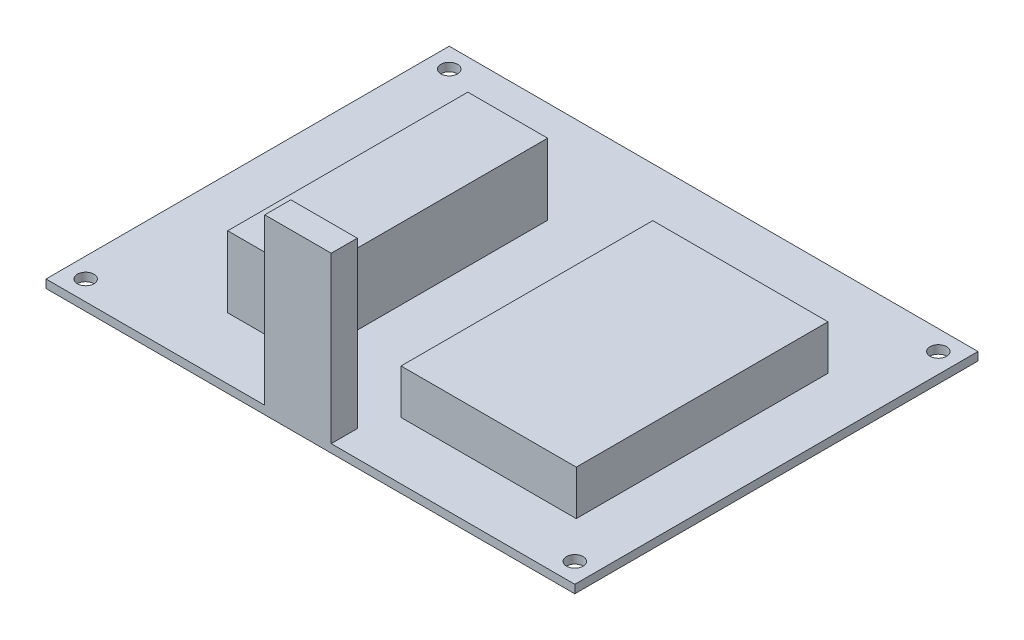
ISO-10303-21;
HEADER;
FILE_DESCRIPTION(('STEP AP214'),'2;1');
FILE_NAME('part.step','',(''),(''),'','','');
FILE_SCHEMA(('AUTOMOTIVE_DESIGN { 1 0 10303 214 1 1 1 1 }'));
ENDSEC;
DATA;
#1=APPLICATION_CONTEXT('core data for automotive mechanical design processes');
#2=APPLICATION_PROTOCOL_DEFINITION('international standard','automotive_design',2000,#1);
#3=PRODUCT_CONTEXT('',#1,'mechanical');
#4=PRODUCT('Part','Part','',(#3));
#5=PRODUCT_RELATED_PRODUCT_CATEGORY('part','',(#4));
#6=PRODUCT_DEFINITION_FORMATION('','',#4);
#7=PRODUCT_DEFINITION_CONTEXT('part definition',#1,'design');
#8=PRODUCT_DEFINITION('design','',#6,#7);
#9=PRODUCT_DEFINITION_SHAPE('','',#8);
#10=(LENGTH_UNIT() NAMED_UNIT(*) SI_UNIT(.MILLI.,.METRE.));
#11=(NAMED_UNIT(*) PLANE_ANGLE_UNIT() SI_UNIT($,.RADIAN.));
#12=(NAMED_UNIT(*) SI_UNIT($,.STERADIAN.) SOLID_ANGLE_UNIT());
#13=UNCERTAINTY_MEASURE_WITH_UNIT(LENGTH_MEASURE(1.E-05),#10,'distance_accuracy_value','');
#14=(GEOMETRIC_REPRESENTATION_CONTEXT(3) GLOBAL_UNCERTAINTY_ASSIGNED_CONTEXT((#13)) GLOBAL_UNIT_ASSIGNED_CONTEXT((#10,
#11,#12)) REPRESENTATION_CONTEXT('',''));
#15=CARTESIAN_POINT('',(0.,0.,0.));
#16=DIRECTION('',(0.,0.,1.));
#17=DIRECTION('',(1.,0.,0.));
#18=AXIS2_PLACEMENT_3D('',#15,#16,#17);
#19=CARTESIAN_POINT('',(0.,1.5875,0.));
#20=DIRECTION('',(0.,1.,0.));
#21=DIRECTION('',(0.,0.,1.));
#22=AXIS2_PLACEMENT_3D('',#19,#20,#21);
#23=PLANE('',#22);
#24=DIRECTION('',(-1.,0.,0.));
#25=VECTOR('',#24,1.);
#26=CARTESIAN_POINT('',(0.,1.5875,11.2894063021906));
#27=LINE('',#26,#25);
#28=CARTESIAN_POINT('',(-6.55312926281065,1.5875,11.2894063021906));
#29=VERTEX_POINT('',#28);
#30=CARTESIAN_POINT('',(-40.2178135144147,1.5875,11.2894063021906));
#31=VERTEX_POINT('',#30);
#32=EDGE_CURVE('E211',#29,#31,#27,.T.);
#33=ORIENTED_EDGE('',*,*,#32,.T.);
#34=DIRECTION('',(0.,0.,-1.));
#35=VECTOR('',#34,1.);
#36=CARTESIAN_POINT('',(-40.2178135144147,1.5875,0.));
#37=LINE('',#36,#35);
#38=CARTESIAN_POINT('',(-40.2178135144147,1.5875,-37.0793929098841));
#39=VERTEX_POINT('',#38);
#40=EDGE_CURVE('E214',#31,#39,#37,.T.);
#41=ORIENTED_EDGE('',*,*,#40,.T.);
#42=DIRECTION('',(1.,0.,0.));
#43=VECTOR('',#42,1.);
#44=CARTESIAN_POINT('',(0.,1.5875,-37.0793929098841));
#45=LINE('',#44,#43);
#46=CARTESIAN_POINT('',(-6.55312926281065,1.5875,-37.0793929098841));
#47=VERTEX_POINT('',#46);
#48=EDGE_CURVE('E205',#39,#47,#45,.T.);
#49=ORIENTED_EDGE('',*,*,#48,.T.);
#50=DIRECTION('',(0.,0.,1.));
#51=VECTOR('',#50,1.);
#52=CARTESIAN_POINT('',(-6.55312926281065,1.5875,0.));
#53=LINE('',#52,#51);
#54=EDGE_CURVE('E208',#47,#29,#53,.T.);
#55=ORIENTED_EDGE('',*,*,#54,.T.);
#56=EDGE_LOOP('',(#33,#41,#49,#55));
#57=FACE_BOUND('',#56,.T.);
#58=CARTESIAN_POINT('',(-93.5609765361476,1.5875,18.5415943631717));
#59=DIRECTION('',(0.,1.,0.));
#60=DIRECTION('',(0.,0.,1.));
#61=AXIS2_PLACEMENT_3D('',#58,#59,#60);
#62=CIRCLE('',#61,1.6002);
#63=CARTESIAN_POINT('',(-93.5609765361476,1.5875,20.1417943631717));
#64=VERTEX_POINT('',#63);
#65=EDGE_CURVE('E256',#64,#64,#62,.T.);
#66=ORIENTED_EDGE('',*,*,#65,.F.);
#67=EDGE_LOOP('',(#66));
#68=FACE_BOUND('',#67,.T.);
#69=CARTESIAN_POINT('',(-93.5609765361476,1.5875,-51.3084056368283));
#70=DIRECTION('',(0.,1.,0.));
#71=DIRECTION('',(0.,0.,1.));
#72=AXIS2_PLACEMENT_3D('',#69,#70,#71);
#73=CIRCLE('',#72,1.6002);
#74=CARTESIAN_POINT('',(-93.5609765361476,1.5875,-49.7082056368283));
#75=VERTEX_POINT('',#74);
#76=EDGE_CURVE('E252',#75,#75,#73,.T.);
#77=ORIENTED_EDGE('',*,*,#76,.F.);
#78=EDGE_LOOP('',(#77));
#79=FACE_BOUND('',#78,.T.);
#80=CARTESIAN_POINT('',(0.419023463852378,1.5875,-51.3084056368283));
#81=DIRECTION('',(0.,1.,0.));
#82=DIRECTION('',(0.,0.,1.));
#83=AXIS2_PLACEMENT_3D('',#80,#81,#82);
#84=CIRCLE('',#83,1.6002);
#85=CARTESIAN_POINT('',(0.419023463852378,1.5875,-49.7082056368283));
#86=VERTEX_POINT('',#85);
#87=EDGE_CURVE('E248',#86,#86,#84,.T.);
#88=ORIENTED_EDGE('',*,*,#87,.F.);
#89=EDGE_LOOP('',(#88));
#90=FACE_BOUND('',#89,.T.);
#91=CARTESIAN_POINT('',(0.419023463852378,1.5875,18.5415943631717));
#92=DIRECTION('',(0.,1.,0.));
#93=DIRECTION('',(0.,0.,1.));
#94=AXIS2_PLACEMENT_3D('',#91,#92,#93);
#95=CIRCLE('',#94,1.6002);
#96=CARTESIAN_POINT('',(0.419023463852378,1.5875,20.1417943631717));
#97=VERTEX_POINT('',#96);
#98=EDGE_CURVE('E245',#97,#97,#95,.T.);
#99=ORIENTED_EDGE('',*,*,#98,.F.);
#100=EDGE_LOOP('',(#99));
#101=FACE_BOUND('',#100,.T.);
#102=DIRECTION('',(1.,0.,0.));
#103=VECTOR('',#102,1.);
#104=CARTESIAN_POINT('',(-97.3709765361476,1.5875,22.3515943631717));
#105=LINE('',#104,#103);
#106=CARTESIAN_POINT('',(-97.3709765361476,1.5875,22.3515943631717));
#107=VERTEX_POINT('',#106);
#108=CARTESIAN_POINT('',(-55.3418521266038,1.5875,22.3515943631717));
#109=VERTEX_POINT('',#108);
#110=EDGE_CURVE('E265',#107,#109,#105,.T.);
#111=ORIENTED_EDGE('',*,*,#110,.T.);
#112=DIRECTION('',(0.,0.,-1.));
#113=VECTOR('',#112,1.);
#114=CARTESIAN_POINT('',(-55.3418521266038,1.5875,0.));
#115=LINE('',#114,#113);
#116=CARTESIAN_POINT('',(-55.3418521266038,1.5875,17.3457703470585));
#117=VERTEX_POINT('',#116);
#118=EDGE_CURVE('E242',#109,#117,#115,.T.);
#119=ORIENTED_EDGE('',*,*,#118,.T.);
#120=DIRECTION('',(1.,0.,0.));
#121=VECTOR('',#120,1.);
#122=CARTESIAN_POINT('',(0.,1.5875,17.3457703470585));
#123=LINE('',#122,#121);
#124=CARTESIAN_POINT('',(-42.5724891346161,1.5875,17.3457703470585));
#125=VERTEX_POINT('',#124);
#126=EDGE_CURVE('E236',#117,#125,#123,.T.);
#127=ORIENTED_EDGE('',*,*,#126,.T.);
#128=DIRECTION('',(0.,0.,1.));
#129=VECTOR('',#128,1.);
#130=CARTESIAN_POINT('',(-42.5724891346161,1.5875,0.));
#131=LINE('',#130,#129);
#132=CARTESIAN_POINT('',(-42.5724891346161,1.5875,22.3515943631717));
#133=VERTEX_POINT('',#132);
#134=EDGE_CURVE('E239',#125,#133,#131,.T.);
#135=ORIENTED_EDGE('',*,*,#134,.T.);
#136=CARTESIAN_POINT('',(4.22902346385238,1.5875,22.3515943631717));
#137=VERTEX_POINT('',#136);
#138=EDGE_CURVE('E263',#133,#137,#105,.T.);
#139=ORIENTED_EDGE('',*,*,#138,.T.);
#140=DIRECTION('',(0.,0.,-1.));
#141=VECTOR('',#140,1.);
#142=CARTESIAN_POINT('',(4.22902346385237,1.5875,-55.1184056368283));
#143=LINE('',#142,#141);
#144=CARTESIAN_POINT('',(4.22902346385237,1.5875,-55.1184056368283));
#145=VERTEX_POINT('',#144);
#146=EDGE_CURVE('E268',#137,#145,#143,.T.);
#147=ORIENTED_EDGE('',*,*,#146,.T.);
#148=DIRECTION('',(-1.,0.,0.));
#149=VECTOR('',#148,1.);
#150=CARTESIAN_POINT('',(-97.3709765361476,1.5875,-55.1184056368283));
#151=LINE('',#150,#149);
#152=CARTESIAN_POINT('',(-97.3709765361476,1.5875,-55.1184056368283));
#153=VERTEX_POINT('',#152);
#154=EDGE_CURVE('E270',#145,#153,#151,.T.);
#155=ORIENTED_EDGE('',*,*,#154,.T.);
#156=DIRECTION('',(0.,0.,1.));
#157=VECTOR('',#156,1.);
#158=CARTESIAN_POINT('',(-97.3709765361476,1.5875,-55.1184056368283));
#159=LINE('',#158,#157);
#160=EDGE_CURVE('E260',#153,#107,#159,.T.);
#161=ORIENTED_EDGE('',*,*,#160,.T.);
#162=EDGE_LOOP('',(#111,#119,#127,#135,#139,#147,#155,#161));
#163=FACE_BOUND('',#162,.T.);
#164=DIRECTION('',(-1.,0.,0.));
#165=VECTOR('',#164,1.);
#166=CARTESIAN_POINT('',(0.,1.5875,10.5252572660355));
#167=LINE('',#166,#165);
#168=CARTESIAN_POINT('',(-58.9533891344387,1.5875,10.5252572660355));
#169=VERTEX_POINT('',#168);
#170=CARTESIAN_POINT('',(-74.2857110092485,1.5875,10.5252572660355));
#171=VERTEX_POINT('',#170);
#172=EDGE_CURVE('E183',#169,#171,#167,.T.);
#173=ORIENTED_EDGE('',*,*,#172,.T.);
#174=DIRECTION('',(0.,0.,-1.));
#175=VECTOR('',#174,1.);
#176=CARTESIAN_POINT('',(-74.2857110092485,1.5875,0.));
#177=LINE('',#176,#175);
#178=CARTESIAN_POINT('',(-74.2857110092485,1.5875,-35.6136948446562));
#179=VERTEX_POINT('',#178);
#180=EDGE_CURVE('E172',#171,#179,#177,.T.);
#181=ORIENTED_EDGE('',*,*,#180,.T.);
#182=DIRECTION('',(1.,0.,0.));
#183=VECTOR('',#182,1.);
#184=CARTESIAN_POINT('',(0.,1.5875,-35.6136948446562));
#185=LINE('',#184,#183);
#186=CARTESIAN_POINT('',(-58.9533891344387,1.5875,-35.6136948446562));
#187=VERTEX_POINT('',#186);
#188=EDGE_CURVE('E173',#179,#187,#185,.T.);
#189=ORIENTED_EDGE('',*,*,#188,.T.);
#190=DIRECTION('',(0.,0.,1.));
#191=VECTOR('',#190,1.);
#192=CARTESIAN_POINT('',(-58.9533891344387,1.5875,0.));
#193=LINE('',#192,#191);
#194=EDGE_CURVE('E176',#187,#169,#193,.T.);
#195=ORIENTED_EDGE('',*,*,#194,.T.);
#196=EDGE_LOOP('',(#173,#181,#189,#195));
#197=FACE_BOUND('',#196,.T.);
#198=ADVANCED_FACE('F33',(#57,#68,#79,#90,#101,#163,#197),#23,.T.);
#199=CARTESIAN_POINT('',(-97.3709765361476,1.5875,-55.1184056368283));
#200=DIRECTION('',(1.,0.,0.));
#201=DIRECTION('',(0.,0.,-1.));
#202=AXIS2_PLACEMENT_3D('',#199,#200,#201);
#203=PLANE('',#202);
#204=DIRECTION('',(0.,0.,1.));
#205=VECTOR('',#204,1.);
#206=CARTESIAN_POINT('',(-97.3709765361476,0.,-55.1184056368283));
#207=LINE('',#206,#205);
#208=CARTESIAN_POINT('',(-97.3709765361476,0.,-55.1184056368283));
#209=VERTEX_POINT('',#208);
#210=CARTESIAN_POINT('',(-97.3709765361476,0.,22.3515943631717));
#211=VERTEX_POINT('',#210);
#212=EDGE_CURVE('E273',#209,#211,#207,.T.);
#213=ORIENTED_EDGE('',*,*,#212,.T.);
#214=DIRECTION('',(0.,-1.,0.));
#215=VECTOR('',#214,1.);
#216=CARTESIAN_POINT('',(-97.3709765361476,1.5875,22.3515943631717));
#217=LINE('',#216,#215);
#218=EDGE_CURVE('E11',#107,#211,#217,.T.);
#219=ORIENTED_EDGE('',*,*,#218,.F.);
#220=ORIENTED_EDGE('',*,*,#160,.F.);
#221=DIRECTION('',(0.,-1.,0.));
#222=VECTOR('',#221,1.);
#223=CARTESIAN_POINT('',(-97.3709765361476,1.5875,-55.1184056368283));
#224=LINE('',#223,#222);
#225=EDGE_CURVE('E272',#153,#209,#224,.T.);
#226=ORIENTED_EDGE('',*,*,#225,.T.);
#227=EDGE_LOOP('',(#213,#219,#220,#226));
#228=FACE_BOUND('',#227,.T.);
#229=ADVANCED_FACE('F35',(#228),#203,.F.);
#230=CARTESIAN_POINT('',(-97.3709765361476,1.5875,22.3515943631717));
#231=DIRECTION('',(0.,0.,-1.));
#232=DIRECTION('',(-1.,0.,0.));
#233=AXIS2_PLACEMENT_3D('',#230,#231,#232);
#234=PLANE('',#233);
#235=DIRECTION('',(1.,0.,0.));
#236=VECTOR('',#235,1.);
#237=CARTESIAN_POINT('',(-97.3709765361476,0.,22.3515943631717));
#238=LINE('',#237,#236);
#239=CARTESIAN_POINT('',(4.22902346385238,0.,22.3515943631717));
#240=VERTEX_POINT('',#239);
#241=EDGE_CURVE('E276',#211,#240,#238,.T.);
#242=ORIENTED_EDGE('',*,*,#241,.T.);
#243=DIRECTION('',(0.,-1.,0.));
#244=VECTOR('',#243,1.);
#245=CARTESIAN_POINT('',(4.22902346385238,1.5875,22.3515943631717));
#246=LINE('',#245,#244);
#247=EDGE_CURVE('E42',#137,#240,#246,.T.);
#248=ORIENTED_EDGE('',*,*,#247,.F.);
#249=ORIENTED_EDGE('',*,*,#138,.F.);
#250=DIRECTION('',(0.,-1.,0.));
#251=VECTOR('',#250,1.);
#252=CARTESIAN_POINT('',(-42.5724891346161,33.274,22.3515943631717));
#253=LINE('',#252,#251);
#254=CARTESIAN_POINT('',(-42.5724891346161,33.274,22.3515943631717));
#255=VERTEX_POINT('',#254);
#256=EDGE_CURVE('E231',#255,#133,#253,.T.);
#257=ORIENTED_EDGE('',*,*,#256,.F.);
#258=DIRECTION('',(1.,0.,0.));
#259=VECTOR('',#258,1.);
#260=CARTESIAN_POINT('',(-55.3418521266038,33.274,22.3515943631717));
#261=LINE('',#260,#259);
#262=CARTESIAN_POINT('',(-55.3418521266038,33.274,22.3515943631717));
#263=VERTEX_POINT('',#262);
#264=EDGE_CURVE('E220',#263,#255,#261,.T.);
#265=ORIENTED_EDGE('',*,*,#264,.F.);
#266=DIRECTION('',(0.,-1.,0.));
#267=VECTOR('',#266,1.);
#268=CARTESIAN_POINT('',(-55.3418521266038,33.274,22.3515943631717));
#269=LINE('',#268,#267);
#270=EDGE_CURVE('E233',#263,#109,#269,.T.);
#271=ORIENTED_EDGE('',*,*,#270,.T.);
#272=ORIENTED_EDGE('',*,*,#110,.F.);
#273=ORIENTED_EDGE('',*,*,#218,.T.);
#274=EDGE_LOOP('',(#242,#248,#249,#257,#265,#271,#272,#273));
#275=FACE_BOUND('',#274,.T.);
#276=ADVANCED_FACE('F319',(#275),#234,.F.);
#277=CARTESIAN_POINT('',(4.22902346385237,1.5875,-55.1184056368283));
#278=DIRECTION('',(-1.,0.,0.));
#279=DIRECTION('',(0.,0.,1.));
#280=AXIS2_PLACEMENT_3D('',#277,#278,#279);
#281=PLANE('',#280);
#282=DIRECTION('',(0.,0.,-1.));
#283=VECTOR('',#282,1.);
#284=CARTESIAN_POINT('',(4.22902346385237,0.,-55.1184056368283));
#285=LINE('',#284,#283);
#286=CARTESIAN_POINT('',(4.22902346385237,0.,-55.1184056368283));
#287=VERTEX_POINT('',#286);
#288=EDGE_CURVE('E278',#240,#287,#285,.T.);
#289=ORIENTED_EDGE('',*,*,#288,.T.);
#290=DIRECTION('',(0.,-1.,0.));
#291=VECTOR('',#290,1.);
#292=CARTESIAN_POINT('',(4.22902346385237,1.5875,-55.1184056368283));
#293=LINE('',#292,#291);
#294=EDGE_CURVE('E283',#145,#287,#293,.T.);
#295=ORIENTED_EDGE('',*,*,#294,.F.);
#296=ORIENTED_EDGE('',*,*,#146,.F.);
#297=ORIENTED_EDGE('',*,*,#247,.T.);
#298=EDGE_LOOP('',(#289,#295,#296,#297));
#299=FACE_BOUND('',#298,.T.);
#300=ADVANCED_FACE('F330',(#299),#281,.F.);
#301=CARTESIAN_POINT('',(-97.3709765361476,1.5875,-55.1184056368283));
#302=DIRECTION('',(0.,0.,1.));
#303=DIRECTION('',(1.,0.,0.));
#304=AXIS2_PLACEMENT_3D('',#301,#302,#303);
#305=PLANE('',#304);
#306=DIRECTION('',(-1.,0.,0.));
#307=VECTOR('',#306,1.);
#308=CARTESIAN_POINT('',(-97.3709765361476,0.,-55.1184056368283));
#309=LINE('',#308,#307);
#310=EDGE_CURVE('E264',#287,#209,#309,.T.);
#311=ORIENTED_EDGE('',*,*,#310,.T.);
#312=ORIENTED_EDGE('',*,*,#225,.F.);
#313=ORIENTED_EDGE('',*,*,#154,.F.);
#314=ORIENTED_EDGE('',*,*,#294,.T.);
#315=EDGE_LOOP('',(#311,#312,#313,#314));
#316=FACE_BOUND('',#315,.T.);
#317=ADVANCED_FACE('F326',(#316),#305,.F.);
#318=CARTESIAN_POINT('',(0.,0.,0.));
#319=DIRECTION('',(0.,1.,0.));
#320=DIRECTION('',(0.,0.,1.));
#321=AXIS2_PLACEMENT_3D('',#318,#319,#320);
#322=PLANE('',#321);
#323=ORIENTED_EDGE('',*,*,#288,.F.);
#324=ORIENTED_EDGE('',*,*,#241,.F.);
#325=ORIENTED_EDGE('',*,*,#212,.F.);
#326=ORIENTED_EDGE('',*,*,#310,.F.);
#327=EDGE_LOOP('',(#323,#324,#325,#326));
#328=FACE_BOUND('',#327,.T.);
#329=CARTESIAN_POINT('',(-93.5609765361476,0.,18.5415943631717));
#330=DIRECTION('',(0.,1.,0.));
#331=DIRECTION('',(0.,0.,1.));
#332=AXIS2_PLACEMENT_3D('',#329,#330,#331);
#333=CIRCLE('',#332,1.6002);
#334=CARTESIAN_POINT('',(-93.5609765361476,0.,20.1417943631717));
#335=VERTEX_POINT('',#334);
#336=EDGE_CURVE('E259',#335,#335,#333,.T.);
#337=ORIENTED_EDGE('',*,*,#336,.T.);
#338=EDGE_LOOP('',(#337));
#339=FACE_BOUND('',#338,.T.);
#340=CARTESIAN_POINT('',(-93.5609765361476,0.,-51.3084056368283));
#341=DIRECTION('',(0.,1.,0.));
#342=DIRECTION('',(0.,0.,1.));
#343=AXIS2_PLACEMENT_3D('',#340,#341,#342);
#344=CIRCLE('',#343,1.6002);
#345=CARTESIAN_POINT('',(-93.5609765361476,0.,-49.7082056368283));
#346=VERTEX_POINT('',#345);
#347=EDGE_CURVE('E255',#346,#346,#344,.T.);
#348=ORIENTED_EDGE('',*,*,#347,.T.);
#349=EDGE_LOOP('',(#348));
#350=FACE_BOUND('',#349,.T.);
#351=CARTESIAN_POINT('',(0.419023463852378,0.,-51.3084056368283));
#352=DIRECTION('',(0.,1.,0.));
#353=DIRECTION('',(0.,0.,1.));
#354=AXIS2_PLACEMENT_3D('',#351,#352,#353);
#355=CIRCLE('',#354,1.6002);
#356=CARTESIAN_POINT('',(0.419023463852378,0.,-49.7082056368283));
#357=VERTEX_POINT('',#356);
#358=EDGE_CURVE('E251',#357,#357,#355,.T.);
#359=ORIENTED_EDGE('',*,*,#358,.T.);
#360=EDGE_LOOP('',(#359));
#361=FACE_BOUND('',#360,.T.);
#362=CARTESIAN_POINT('',(0.419023463852378,0.,18.5415943631717));
#363=DIRECTION('',(0.,1.,0.));
#364=DIRECTION('',(0.,0.,1.));
#365=AXIS2_PLACEMENT_3D('',#362,#363,#364);
#366=CIRCLE('',#365,1.6002);
#367=CARTESIAN_POINT('',(0.419023463852378,0.,20.1417943631717));
#368=VERTEX_POINT('',#367);
#369=EDGE_CURVE('E37',#368,#368,#366,.T.);
#370=ORIENTED_EDGE('',*,*,#369,.T.);
#371=EDGE_LOOP('',(#370));
#372=FACE_BOUND('',#371,.T.);
#373=ADVANCED_FACE('F294',(#328,#339,#350,#361,#372),#322,.F.);
#374=CARTESIAN_POINT('',(-93.5609765361476,-0.9525,18.5415943631717));
#375=DIRECTION('',(0.,1.,0.));
#376=DIRECTION('',(0.,0.,1.));
#377=AXIS2_PLACEMENT_3D('',#374,#375,#376);
#378=CYLINDRICAL_SURFACE('',#377,1.6002);
#379=ORIENTED_EDGE('',*,*,#65,.T.);
#380=EDGE_LOOP('',(#379));
#381=FACE_BOUND('',#380,.T.);
#382=ORIENTED_EDGE('',*,*,#336,.F.);
#383=EDGE_LOOP('',(#382));
#384=FACE_BOUND('',#383,.T.);
#385=ADVANCED_FACE('F310',(#381,#384),#378,.F.);
#386=CARTESIAN_POINT('',(-93.5609765361476,-0.9525,-51.3084056368283));
#387=DIRECTION('',(0.,1.,0.));
#388=DIRECTION('',(0.,0.,1.));
#389=AXIS2_PLACEMENT_3D('',#386,#387,#388);
#390=CYLINDRICAL_SURFACE('',#389,1.6002);
#391=ORIENTED_EDGE('',*,*,#76,.T.);
#392=EDGE_LOOP('',(#391));
#393=FACE_BOUND('',#392,.T.);
#394=ORIENTED_EDGE('',*,*,#347,.F.);
#395=EDGE_LOOP('',(#394));
#396=FACE_BOUND('',#395,.T.);
#397=ADVANCED_FACE('F300',(#393,#396),#390,.F.);
#398=CARTESIAN_POINT('',(0.419023463852378,-0.9525,-51.3084056368283));
#399=DIRECTION('',(0.,1.,0.));
#400=DIRECTION('',(0.,0.,1.));
#401=AXIS2_PLACEMENT_3D('',#398,#399,#400);
#402=CYLINDRICAL_SURFACE('',#401,1.6002);
#403=ORIENTED_EDGE('',*,*,#87,.T.);
#404=EDGE_LOOP('',(#403));
#405=FACE_BOUND('',#404,.T.);
#406=ORIENTED_EDGE('',*,*,#358,.F.);
#407=EDGE_LOOP('',(#406));
#408=FACE_BOUND('',#407,.T.);
#409=ADVANCED_FACE('F297',(#405,#408),#402,.F.);
#410=CARTESIAN_POINT('',(0.419023463852378,-0.9525,18.5415943631717));
#411=DIRECTION('',(0.,1.,0.));
#412=DIRECTION('',(0.,0.,1.));
#413=AXIS2_PLACEMENT_3D('',#410,#411,#412);
#414=CYLINDRICAL_SURFACE('',#413,1.6002);
#415=ORIENTED_EDGE('',*,*,#98,.T.);
#416=EDGE_LOOP('',(#415));
#417=FACE_BOUND('',#416,.T.);
#418=ORIENTED_EDGE('',*,*,#369,.F.);
#419=EDGE_LOOP('',(#418));
#420=FACE_BOUND('',#419,.T.);
#421=ADVANCED_FACE('F299',(#417,#420),#414,.F.);
#422=CARTESIAN_POINT('',(-55.3418521266038,33.274,22.3515943631717));
#423=DIRECTION('',(1.,0.,0.));
#424=DIRECTION('',(0.,0.,-1.));
#425=AXIS2_PLACEMENT_3D('',#422,#423,#424);
#426=PLANE('',#425);
#427=ORIENTED_EDGE('',*,*,#118,.F.);
#428=ORIENTED_EDGE('',*,*,#270,.F.);
#429=DIRECTION('',(0.,0.,1.));
#430=VECTOR('',#429,1.);
#431=CARTESIAN_POINT('',(-55.3418521266038,33.274,22.3515943631717));
#432=LINE('',#431,#430);
#433=CARTESIAN_POINT('',(-55.3418521266038,33.274,17.3457703470585));
#434=VERTEX_POINT('',#433);
#435=EDGE_CURVE('E217',#434,#263,#432,.T.);
#436=ORIENTED_EDGE('',*,*,#435,.F.);
#437=DIRECTION('',(0.,-1.,0.));
#438=VECTOR('',#437,1.);
#439=CARTESIAN_POINT('',(-55.3418521266038,33.274,17.3457703470585));
#440=LINE('',#439,#438);
#441=EDGE_CURVE('E226',#434,#117,#440,.T.);
#442=ORIENTED_EDGE('',*,*,#441,.T.);
#443=EDGE_LOOP('',(#427,#428,#436,#442));
#444=FACE_BOUND('',#443,.T.);
#445=ADVANCED_FACE('F307',(#444),#426,.F.);
#446=CARTESIAN_POINT('',(-42.5724891346161,33.274,22.3515943631717));
#447=DIRECTION('',(-1.,0.,0.));
#448=DIRECTION('',(0.,0.,1.));
#449=AXIS2_PLACEMENT_3D('',#446,#447,#448);
#450=PLANE('',#449);
#451=ORIENTED_EDGE('',*,*,#134,.F.);
#452=DIRECTION('',(0.,-1.,0.));
#453=VECTOR('',#452,1.);
#454=CARTESIAN_POINT('',(-42.5724891346161,33.274,17.3457703470585));
#455=LINE('',#454,#453);
#456=CARTESIAN_POINT('',(-42.5724891346161,33.274,17.3457703470585));
#457=VERTEX_POINT('',#456);
#458=EDGE_CURVE('E229',#457,#125,#455,.T.);
#459=ORIENTED_EDGE('',*,*,#458,.F.);
#460=DIRECTION('',(0.,0.,-1.));
#461=VECTOR('',#460,1.);
#462=CARTESIAN_POINT('',(-42.5724891346161,33.274,22.3515943631717));
#463=LINE('',#462,#461);
#464=EDGE_CURVE('E222',#255,#457,#463,.T.);
#465=ORIENTED_EDGE('',*,*,#464,.F.);
#466=ORIENTED_EDGE('',*,*,#256,.T.);
#467=EDGE_LOOP('',(#451,#459,#465,#466));
#468=FACE_BOUND('',#467,.T.);
#469=ADVANCED_FACE('F357',(#468),#450,.F.);
#470=CARTESIAN_POINT('',(-55.3418521266038,33.274,17.3457703470585));
#471=DIRECTION('',(0.,0.,1.));
#472=DIRECTION('',(1.,0.,0.));
#473=AXIS2_PLACEMENT_3D('',#470,#471,#472);
#474=PLANE('',#473);
#475=ORIENTED_EDGE('',*,*,#126,.F.);
#476=ORIENTED_EDGE('',*,*,#441,.F.);
#477=DIRECTION('',(-1.,0.,0.));
#478=VECTOR('',#477,1.);
#479=CARTESIAN_POINT('',(-55.3418521266038,33.274,17.3457703470585));
#480=LINE('',#479,#478);
#481=EDGE_CURVE('E224',#457,#434,#480,.T.);
#482=ORIENTED_EDGE('',*,*,#481,.F.);
#483=ORIENTED_EDGE('',*,*,#458,.T.);
#484=EDGE_LOOP('',(#475,#476,#482,#483));
#485=FACE_BOUND('',#484,.T.);
#486=ADVANCED_FACE('F366',(#485),#474,.F.);
#487=CARTESIAN_POINT('',(0.,33.274,0.));
#488=DIRECTION('',(0.,-1.,0.));
#489=DIRECTION('',(0.,0.,-1.));
#490=AXIS2_PLACEMENT_3D('',#487,#488,#489);
#491=PLANE('',#490);
#492=ORIENTED_EDGE('',*,*,#435,.T.);
#493=ORIENTED_EDGE('',*,*,#264,.T.);
#494=ORIENTED_EDGE('',*,*,#464,.T.);
#495=ORIENTED_EDGE('',*,*,#481,.T.);
#496=EDGE_LOOP('',(#492,#493,#494,#495));
#497=FACE_BOUND('',#496,.T.);
#498=ADVANCED_FACE('F360',(#497),#491,.F.);
#499=CARTESIAN_POINT('',(-40.2178135144147,10.16,-37.0793929098841));
#500=DIRECTION('',(1.,0.,0.));
#501=DIRECTION('',(0.,0.,-1.));
#502=AXIS2_PLACEMENT_3D('',#499,#500,#501);
#503=PLANE('',#502);
#504=ORIENTED_EDGE('',*,*,#40,.F.);
#505=DIRECTION('',(0.,-1.,0.));
#506=VECTOR('',#505,1.);
#507=CARTESIAN_POINT('',(-40.2178135144147,10.16,11.2894063021906));
#508=LINE('',#507,#506);
#509=CARTESIAN_POINT('',(-40.2178135144147,10.16,11.2894063021906));
#510=VERTEX_POINT('',#509);
#511=EDGE_CURVE('E202',#510,#31,#508,.T.);
#512=ORIENTED_EDGE('',*,*,#511,.F.);
#513=DIRECTION('',(0.,0.,1.));
#514=VECTOR('',#513,1.);
#515=CARTESIAN_POINT('',(-40.2178135144147,10.16,-37.0793929098841));
#516=LINE('',#515,#514);
#517=CARTESIAN_POINT('',(-40.2178135144147,10.16,-37.0793929098841));
#518=VERTEX_POINT('',#517);
#519=EDGE_CURVE('E186',#518,#510,#516,.T.);
#520=ORIENTED_EDGE('',*,*,#519,.F.);
#521=DIRECTION('',(0.,-1.,0.));
#522=VECTOR('',#521,1.);
#523=CARTESIAN_POINT('',(-40.2178135144147,10.16,-37.0793929098841));
#524=LINE('',#523,#522);
#525=EDGE_CURVE('E195',#518,#39,#524,.T.);
#526=ORIENTED_EDGE('',*,*,#525,.T.);
#527=EDGE_LOOP('',(#504,#512,#520,#526));
#528=FACE_BOUND('',#527,.T.);
#529=ADVANCED_FACE('F373',(#528),#503,.F.);
#530=CARTESIAN_POINT('',(-40.2178135144147,10.16,11.2894063021906));
#531=DIRECTION('',(0.,0.,-1.));
#532=DIRECTION('',(-1.,0.,0.));
#533=AXIS2_PLACEMENT_3D('',#530,#531,#532);
#534=PLANE('',#533);
#535=ORIENTED_EDGE('',*,*,#32,.F.);
#536=DIRECTION('',(0.,-1.,0.));
#537=VECTOR('',#536,1.);
#538=CARTESIAN_POINT('',(-6.55312926281065,10.16,11.2894063021906));
#539=LINE('',#538,#537);
#540=CARTESIAN_POINT('',(-6.55312926281065,10.16,11.2894063021906));
#541=VERTEX_POINT('',#540);
#542=EDGE_CURVE('E199',#541,#29,#539,.T.);
#543=ORIENTED_EDGE('',*,*,#542,.F.);
#544=DIRECTION('',(1.,0.,0.));
#545=VECTOR('',#544,1.);
#546=CARTESIAN_POINT('',(-40.2178135144147,10.16,11.2894063021906));
#547=LINE('',#546,#545);
#548=EDGE_CURVE('E189',#510,#541,#547,.T.);
#549=ORIENTED_EDGE('',*,*,#548,.F.);
#550=ORIENTED_EDGE('',*,*,#511,.T.);
#551=EDGE_LOOP('',(#535,#543,#549,#550));
#552=FACE_BOUND('',#551,.T.);
#553=ADVANCED_FACE('F406',(#552),#534,.F.);
#554=CARTESIAN_POINT('',(-6.55312926281065,10.16,-37.0793929098841));
#555=DIRECTION('',(-1.,0.,0.));
#556=DIRECTION('',(0.,0.,1.));
#557=AXIS2_PLACEMENT_3D('',#554,#555,#556);
#558=PLANE('',#557);
#559=ORIENTED_EDGE('',*,*,#54,.F.);
#560=DIRECTION('',(0.,-1.,0.));
#561=VECTOR('',#560,1.);
#562=CARTESIAN_POINT('',(-6.55312926281065,10.16,-37.0793929098841));
#563=LINE('',#562,#561);
#564=CARTESIAN_POINT('',(-6.55312926281065,10.16,-37.0793929098841));
#565=VERTEX_POINT('',#564);
#566=EDGE_CURVE('E58',#565,#47,#563,.T.);
#567=ORIENTED_EDGE('',*,*,#566,.F.);
#568=DIRECTION('',(0.,0.,-1.));
#569=VECTOR('',#568,1.);
#570=CARTESIAN_POINT('',(-6.55312926281065,10.16,-37.0793929098841));
#571=LINE('',#570,#569);
#572=EDGE_CURVE('E191',#541,#565,#571,.T.);
#573=ORIENTED_EDGE('',*,*,#572,.F.);
#574=ORIENTED_EDGE('',*,*,#542,.T.);
#575=EDGE_LOOP('',(#559,#567,#573,#574));
#576=FACE_BOUND('',#575,.T.);
#577=ADVANCED_FACE('F415',(#576),#558,.F.);
#578=CARTESIAN_POINT('',(-40.2178135144147,10.16,-37.0793929098841));
#579=DIRECTION('',(0.,0.,1.));
#580=DIRECTION('',(1.,0.,0.));
#581=AXIS2_PLACEMENT_3D('',#578,#579,#580);
#582=PLANE('',#581);
#583=ORIENTED_EDGE('',*,*,#48,.F.);
#584=ORIENTED_EDGE('',*,*,#525,.F.);
#585=DIRECTION('',(-1.,0.,0.));
#586=VECTOR('',#585,1.);
#587=CARTESIAN_POINT('',(-40.2178135144147,10.16,-37.0793929098841));
#588=LINE('',#587,#586);
#589=EDGE_CURVE('E193',#565,#518,#588,.T.);
#590=ORIENTED_EDGE('',*,*,#589,.F.);
#591=ORIENTED_EDGE('',*,*,#566,.T.);
#592=EDGE_LOOP('',(#583,#584,#590,#591));
#593=FACE_BOUND('',#592,.T.);
#594=ADVANCED_FACE('F425',(#593),#582,.F.);
#595=CARTESIAN_POINT('',(0.,10.16,0.));
#596=DIRECTION('',(0.,1.,0.));
#597=DIRECTION('',(0.,0.,1.));
#598=AXIS2_PLACEMENT_3D('',#595,#596,#597);
#599=PLANE('',#598);
#600=ORIENTED_EDGE('',*,*,#519,.T.);
#601=ORIENTED_EDGE('',*,*,#548,.T.);
#602=ORIENTED_EDGE('',*,*,#572,.T.);
#603=ORIENTED_EDGE('',*,*,#589,.T.);
#604=EDGE_LOOP('',(#600,#601,#602,#603));
#605=FACE_BOUND('',#604,.T.);
#606=ADVANCED_FACE('F435',(#605),#599,.T.);
#607=CARTESIAN_POINT('',(-74.2857110092485,15.24,-35.6136948446562));
#608=DIRECTION('',(1.,0.,0.));
#609=DIRECTION('',(0.,0.,-1.));
#610=AXIS2_PLACEMENT_3D('',#607,#608,#609);
#611=PLANE('',#610);
#612=ORIENTED_EDGE('',*,*,#180,.F.);
#613=DIRECTION('',(0.,-1.,0.));
#614=VECTOR('',#613,1.);
#615=CARTESIAN_POINT('',(-74.2857110092485,15.24,10.5252572660355));
#616=LINE('',#615,#614);
#617=CARTESIAN_POINT('',(-74.2857110092485,15.24,10.5252572660355));
#618=VERTEX_POINT('',#617);
#619=EDGE_CURVE('E154',#618,#171,#616,.T.);
#620=ORIENTED_EDGE('',*,*,#619,.F.);
#621=DIRECTION('',(0.,0.,1.));
#622=VECTOR('',#621,1.);
#623=CARTESIAN_POINT('',(-74.2857110092485,15.24,-35.6136948446562));
#624=LINE('',#623,#622);
#625=CARTESIAN_POINT('',(-74.2857110092485,15.24,-35.6136948446562));
#626=VERTEX_POINT('',#625);
#627=EDGE_CURVE('E161',#626,#618,#624,.T.);
#628=ORIENTED_EDGE('',*,*,#627,.F.);
#629=DIRECTION('',(0.,-1.,0.));
#630=VECTOR('',#629,1.);
#631=CARTESIAN_POINT('',(-74.2857110092485,15.24,-35.6136948446562));
#632=LINE('',#631,#630);
#633=EDGE_CURVE('E504',#626,#179,#632,.T.);
#634=ORIENTED_EDGE('',*,*,#633,.T.);
#635=EDGE_LOOP('',(#612,#620,#628,#634));
#636=FACE_BOUND('',#635,.T.);
#637=ADVANCED_FACE('F170',(#636),#611,.F.);
#638=CARTESIAN_POINT('',(-74.2857110092485,15.24,10.5252572660355));
#639=DIRECTION('',(0.,0.,-1.));
#640=DIRECTION('',(-1.,0.,0.));
#641=AXIS2_PLACEMENT_3D('',#638,#639,#640);
#642=PLANE('',#641);
#643=ORIENTED_EDGE('',*,*,#172,.F.);
#644=DIRECTION('',(0.,-1.,0.));
#645=VECTOR('',#644,1.);
#646=CARTESIAN_POINT('',(-58.9533891344387,15.24,10.5252572660355));
#647=LINE('',#646,#645);
#648=CARTESIAN_POINT('',(-58.9533891344387,15.24,10.5252572660355));
#649=VERTEX_POINT('',#648);
#650=EDGE_CURVE('E157',#649,#169,#647,.T.);
#651=ORIENTED_EDGE('',*,*,#650,.F.);
#652=DIRECTION('',(1.,0.,0.));
#653=VECTOR('',#652,1.);
#654=CARTESIAN_POINT('',(-74.2857110092485,15.24,10.5252572660355));
#655=LINE('',#654,#653);
#656=EDGE_CURVE('E150',#618,#649,#655,.T.);
#657=ORIENTED_EDGE('',*,*,#656,.F.);
#658=ORIENTED_EDGE('',*,*,#619,.T.);
#659=EDGE_LOOP('',(#643,#651,#657,#658));
#660=FACE_BOUND('',#659,.T.);
#661=ADVANCED_FACE('F152',(#660),#642,.F.);
#662=CARTESIAN_POINT('',(-58.9533891344387,15.24,-35.6136948446562));
#663=DIRECTION('',(-1.,0.,0.));
#664=DIRECTION('',(0.,0.,1.));
#665=AXIS2_PLACEMENT_3D('',#662,#663,#664);
#666=PLANE('',#665);
#667=ORIENTED_EDGE('',*,*,#194,.F.);
#668=DIRECTION('',(0.,-1.,0.));
#669=VECTOR('',#668,1.);
#670=CARTESIAN_POINT('',(-58.9533891344387,15.24,-35.6136948446562));
#671=LINE('',#670,#669);
#672=CARTESIAN_POINT('',(-58.9533891344387,15.24,-35.6136948446562));
#673=VERTEX_POINT('',#672);
#674=EDGE_CURVE('E50',#673,#187,#671,.T.);
#675=ORIENTED_EDGE('',*,*,#674,.F.);
#676=DIRECTION('',(0.,0.,-1.));
#677=VECTOR('',#676,1.);
#678=CARTESIAN_POINT('',(-58.9533891344387,15.24,-35.6136948446562));
#679=LINE('',#678,#677);
#680=EDGE_CURVE('E160',#649,#673,#679,.T.);
#681=ORIENTED_EDGE('',*,*,#680,.F.);
#682=ORIENTED_EDGE('',*,*,#650,.T.);
#683=EDGE_LOOP('',(#667,#675,#681,#682));
#684=FACE_BOUND('',#683,.T.);
#685=ADVANCED_FACE('F474',(#684),#666,.F.);
#686=CARTESIAN_POINT('',(-74.2857110092485,15.24,-35.6136948446562));
#687=DIRECTION('',(0.,0.,1.));
#688=DIRECTION('',(1.,0.,0.));
#689=AXIS2_PLACEMENT_3D('',#686,#687,#688);
#690=PLANE('',#689);
#691=ORIENTED_EDGE('',*,*,#188,.F.);
#692=ORIENTED_EDGE('',*,*,#633,.F.);
#693=DIRECTION('',(-1.,0.,0.));
#694=VECTOR('',#693,1.);
#695=CARTESIAN_POINT('',(-74.2857110092485,15.24,-35.6136948446562));
#696=LINE('',#695,#694);
#697=EDGE_CURVE('E165',#673,#626,#696,.T.);
#698=ORIENTED_EDGE('',*,*,#697,.F.);
#699=ORIENTED_EDGE('',*,*,#674,.T.);
#700=EDGE_LOOP('',(#691,#692,#698,#699));
#701=FACE_BOUND('',#700,.T.);
#702=ADVANCED_FACE('F483',(#701),#690,.F.);
#703=CARTESIAN_POINT('',(0.,15.24,0.));
#704=DIRECTION('',(0.,1.,0.));
#705=DIRECTION('',(0.,0.,1.));
#706=AXIS2_PLACEMENT_3D('',#703,#704,#705);
#707=PLANE('',#706);
#708=ORIENTED_EDGE('',*,*,#627,.T.);
#709=ORIENTED_EDGE('',*,*,#656,.T.);
#710=ORIENTED_EDGE('',*,*,#680,.T.);
#711=ORIENTED_EDGE('',*,*,#697,.T.);
#712=EDGE_LOOP('',(#708,#709,#710,#711));
#713=FACE_BOUND('',#712,.T.);
#714=ADVANCED_FACE('F164',(#713),#707,.T.);
#715=CLOSED_SHELL('',(#198,#229,#276,#300,#317,#373,#385,#397,#409,#421,#445,#469,#486,#498,
#529,#553,#577,#594,#606,#637,#661,#685,#702,#714));
#716=MANIFOLD_SOLID_BREP('B2',#715);
#717=ADVANCED_BREP_SHAPE_REPRESENTATION('',(#18,#716),#14);
#718=SHAPE_DEFINITION_REPRESENTATION(#9,#717);
ENDSEC;
END-ISO-10303-21;
